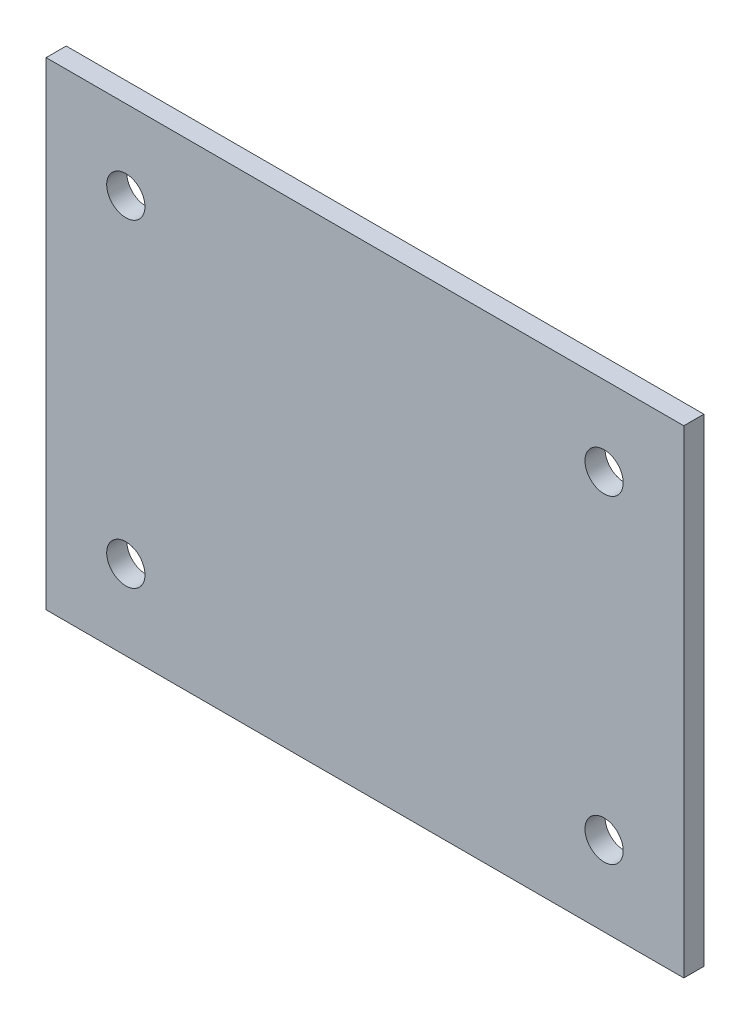
ISO-10303-21;
HEADER;
FILE_DESCRIPTION(('STEP AP214'),'2;1');
FILE_NAME('part.step','',(''),(''),'','','');
FILE_SCHEMA(('AUTOMOTIVE_DESIGN { 1 0 10303 214 1 1 1 1 }'));
ENDSEC;
DATA;
#1=APPLICATION_CONTEXT('core data for automotive mechanical design processes');
#2=APPLICATION_PROTOCOL_DEFINITION('international standard','automotive_design',2000,#1);
#3=PRODUCT_CONTEXT('',#1,'mechanical');
#4=PRODUCT('Part','Part','',(#3));
#5=PRODUCT_RELATED_PRODUCT_CATEGORY('part','',(#4));
#6=PRODUCT_DEFINITION_FORMATION('','',#4);
#7=PRODUCT_DEFINITION_CONTEXT('part definition',#1,'design');
#8=PRODUCT_DEFINITION('design','',#6,#7);
#9=PRODUCT_DEFINITION_SHAPE('','',#8);
#10=(LENGTH_UNIT() NAMED_UNIT(*) SI_UNIT(.MILLI.,.METRE.));
#11=(NAMED_UNIT(*) PLANE_ANGLE_UNIT() SI_UNIT($,.RADIAN.));
#12=(NAMED_UNIT(*) SI_UNIT($,.STERADIAN.) SOLID_ANGLE_UNIT());
#13=UNCERTAINTY_MEASURE_WITH_UNIT(LENGTH_MEASURE(1.E-05),#10,'distance_accuracy_value','');
#14=(GEOMETRIC_REPRESENTATION_CONTEXT(3) GLOBAL_UNCERTAINTY_ASSIGNED_CONTEXT((#13)) GLOBAL_UNIT_ASSIGNED_CONTEXT((#10,
#11,#12)) REPRESENTATION_CONTEXT('',''));
#15=CARTESIAN_POINT('',(0.,0.,0.));
#16=DIRECTION('',(0.,0.,1.));
#17=DIRECTION('',(1.,0.,0.));
#18=AXIS2_PLACEMENT_3D('',#15,#16,#17);
#19=CARTESIAN_POINT('',(0.,0.,1.6002));
#20=DIRECTION('',(1.,0.,0.));
#21=DIRECTION('',(0.,1.,0.));
#22=AXIS2_PLACEMENT_3D('',#19,#20,#21);
#23=PLANE('',#22);
#24=DIRECTION('',(0.,-1.,0.));
#25=VECTOR('',#24,1.);
#26=CARTESIAN_POINT('',(0.,0.,0.));
#27=LINE('',#26,#25);
#28=CARTESIAN_POINT('',(0.,0.,0.));
#29=VERTEX_POINT('',#28);
#30=CARTESIAN_POINT('',(0.,-38.1,0.));
#31=VERTEX_POINT('',#30);
#32=EDGE_CURVE('E74',#29,#31,#27,.T.);
#33=ORIENTED_EDGE('',*,*,#32,.T.);
#34=DIRECTION('',(0.,0.,-1.));
#35=VECTOR('',#34,1.);
#36=CARTESIAN_POINT('',(0.,-38.1,1.6002));
#37=LINE('',#36,#35);
#38=CARTESIAN_POINT('',(0.,-38.1,1.6002));
#39=VERTEX_POINT('',#38);
#40=EDGE_CURVE('E81',#39,#31,#37,.T.);
#41=ORIENTED_EDGE('',*,*,#40,.F.);
#42=DIRECTION('',(0.,-1.,0.));
#43=VECTOR('',#42,1.);
#44=CARTESIAN_POINT('',(0.,0.,1.6002));
#45=LINE('',#44,#43);
#46=CARTESIAN_POINT('',(0.,0.,1.6002));
#47=VERTEX_POINT('',#46);
#48=EDGE_CURVE('E101',#47,#39,#45,.T.);
#49=ORIENTED_EDGE('',*,*,#48,.F.);
#50=DIRECTION('',(0.,0.,-1.));
#51=VECTOR('',#50,1.);
#52=CARTESIAN_POINT('',(0.,0.,1.6002));
#53=LINE('',#52,#51);
#54=EDGE_CURVE('E90',#47,#29,#53,.T.);
#55=ORIENTED_EDGE('',*,*,#54,.T.);
#56=EDGE_LOOP('',(#33,#41,#49,#55));
#57=FACE_BOUND('',#56,.T.);
#58=ADVANCED_FACE('F27',(#57),#23,.F.);
#59=CARTESIAN_POINT('',(0.,-38.1,1.6002));
#60=DIRECTION('',(0.,1.,0.));
#61=DIRECTION('',(0.,0.,1.));
#62=AXIS2_PLACEMENT_3D('',#59,#60,#61);
#63=PLANE('',#62);
#64=DIRECTION('',(1.,0.,0.));
#65=VECTOR('',#64,1.);
#66=CARTESIAN_POINT('',(0.,-38.1,0.));
#67=LINE('',#66,#65);
#68=CARTESIAN_POINT('',(50.8,-38.1,0.));
#69=VERTEX_POINT('',#68);
#70=EDGE_CURVE('E68',#31,#69,#67,.T.);
#71=ORIENTED_EDGE('',*,*,#70,.T.);
#72=DIRECTION('',(0.,0.,-1.));
#73=VECTOR('',#72,1.);
#74=CARTESIAN_POINT('',(50.8,-38.1,1.6002));
#75=LINE('',#74,#73);
#76=CARTESIAN_POINT('',(50.8,-38.1,1.6002));
#77=VERTEX_POINT('',#76);
#78=EDGE_CURVE('E87',#77,#69,#75,.T.);
#79=ORIENTED_EDGE('',*,*,#78,.F.);
#80=DIRECTION('',(1.,0.,0.));
#81=VECTOR('',#80,1.);
#82=CARTESIAN_POINT('',(0.,-38.1,1.6002));
#83=LINE('',#82,#81);
#84=EDGE_CURVE('E83',#39,#77,#83,.T.);
#85=ORIENTED_EDGE('',*,*,#84,.F.);
#86=ORIENTED_EDGE('',*,*,#40,.T.);
#87=EDGE_LOOP('',(#71,#79,#85,#86));
#88=FACE_BOUND('',#87,.T.);
#89=ADVANCED_FACE('F82',(#88),#63,.F.);
#90=CARTESIAN_POINT('',(50.8,0.,1.6002));
#91=DIRECTION('',(-1.,0.,0.));
#92=DIRECTION('',(0.,-1.,0.));
#93=AXIS2_PLACEMENT_3D('',#90,#91,#92);
#94=PLANE('',#93);
#95=DIRECTION('',(0.,1.,0.));
#96=VECTOR('',#95,1.);
#97=CARTESIAN_POINT('',(50.8,0.,0.));
#98=LINE('',#97,#96);
#99=CARTESIAN_POINT('',(50.8,0.,0.));
#100=VERTEX_POINT('',#99);
#101=EDGE_CURVE('E75',#69,#100,#98,.T.);
#102=ORIENTED_EDGE('',*,*,#101,.T.);
#103=DIRECTION('',(0.,0.,-1.));
#104=VECTOR('',#103,1.);
#105=CARTESIAN_POINT('',(50.8,0.,1.6002));
#106=LINE('',#105,#104);
#107=CARTESIAN_POINT('',(50.8,0.,1.6002));
#108=VERTEX_POINT('',#107);
#109=EDGE_CURVE('E107',#108,#100,#106,.T.);
#110=ORIENTED_EDGE('',*,*,#109,.F.);
#111=DIRECTION('',(0.,1.,0.));
#112=VECTOR('',#111,1.);
#113=CARTESIAN_POINT('',(50.8,0.,1.6002));
#114=LINE('',#113,#112);
#115=EDGE_CURVE('E47',#77,#108,#114,.T.);
#116=ORIENTED_EDGE('',*,*,#115,.F.);
#117=ORIENTED_EDGE('',*,*,#78,.T.);
#118=EDGE_LOOP('',(#102,#110,#116,#117));
#119=FACE_BOUND('',#118,.T.);
#120=ADVANCED_FACE('F137',(#119),#94,.F.);
#121=CARTESIAN_POINT('',(0.,0.,1.6002));
#122=DIRECTION('',(0.,-1.,0.));
#123=DIRECTION('',(1.,0.,0.));
#124=AXIS2_PLACEMENT_3D('',#121,#122,#123);
#125=PLANE('',#124);
#126=DIRECTION('',(-1.,0.,0.));
#127=VECTOR('',#126,1.);
#128=CARTESIAN_POINT('',(0.,0.,0.));
#129=LINE('',#128,#127);
#130=EDGE_CURVE('E99',#100,#29,#129,.T.);
#131=ORIENTED_EDGE('',*,*,#130,.T.);
#132=ORIENTED_EDGE('',*,*,#54,.F.);
#133=DIRECTION('',(-1.,0.,0.));
#134=VECTOR('',#133,1.);
#135=CARTESIAN_POINT('',(0.,0.,1.6002));
#136=LINE('',#135,#134);
#137=EDGE_CURVE('E42',#108,#47,#136,.T.);
#138=ORIENTED_EDGE('',*,*,#137,.F.);
#139=ORIENTED_EDGE('',*,*,#109,.T.);
#140=EDGE_LOOP('',(#131,#132,#138,#139));
#141=FACE_BOUND('',#140,.T.);
#142=ADVANCED_FACE('F126',(#141),#125,.F.);
#143=CARTESIAN_POINT('',(0.,-38.1,1.6002));
#144=DIRECTION('',(0.,0.,1.));
#145=DIRECTION('',(1.,0.,0.));
#146=AXIS2_PLACEMENT_3D('',#143,#144,#145);
#147=PLANE('',#146);
#148=CARTESIAN_POINT('',(44.45,-6.35,1.6002));
#149=DIRECTION('',(0.,0.,1.));
#150=DIRECTION('',(1.,0.,0.));
#151=AXIS2_PLACEMENT_3D('',#148,#149,#150);
#152=CIRCLE('',#151,1.524);
#153=CARTESIAN_POINT('',(45.974,-6.35,1.6002));
#154=VERTEX_POINT('',#153);
#155=EDGE_CURVE('E170',#154,#154,#152,.T.);
#156=ORIENTED_EDGE('',*,*,#155,.F.);
#157=EDGE_LOOP('',(#156));
#158=FACE_BOUND('',#157,.T.);
#159=CARTESIAN_POINT('',(6.35,-6.35,1.6002));
#160=DIRECTION('',(0.,0.,1.));
#161=DIRECTION('',(1.,0.,0.));
#162=AXIS2_PLACEMENT_3D('',#159,#160,#161);
#163=CIRCLE('',#162,1.524);
#164=CARTESIAN_POINT('',(7.874,-6.35,1.6002));
#165=VERTEX_POINT('',#164);
#166=EDGE_CURVE('E94',#165,#165,#163,.T.);
#167=ORIENTED_EDGE('',*,*,#166,.F.);
#168=EDGE_LOOP('',(#167));
#169=FACE_BOUND('',#168,.T.);
#170=ORIENTED_EDGE('',*,*,#48,.T.);
#171=ORIENTED_EDGE('',*,*,#84,.T.);
#172=ORIENTED_EDGE('',*,*,#115,.T.);
#173=ORIENTED_EDGE('',*,*,#137,.T.);
#174=EDGE_LOOP('',(#170,#171,#172,#173));
#175=FACE_BOUND('',#174,.T.);
#176=CARTESIAN_POINT('',(6.35,-31.75,1.6002));
#177=DIRECTION('',(0.,0.,1.));
#178=DIRECTION('',(1.,0.,0.));
#179=AXIS2_PLACEMENT_3D('',#176,#177,#178);
#180=CIRCLE('',#179,1.524);
#181=CARTESIAN_POINT('',(7.874,-31.75,1.6002));
#182=VERTEX_POINT('',#181);
#183=EDGE_CURVE('E113',#182,#182,#180,.T.);
#184=ORIENTED_EDGE('',*,*,#183,.F.);
#185=EDGE_LOOP('',(#184));
#186=FACE_BOUND('',#185,.T.);
#187=CARTESIAN_POINT('',(44.45,-31.75,1.6002));
#188=DIRECTION('',(0.,0.,1.));
#189=DIRECTION('',(1.,0.,0.));
#190=AXIS2_PLACEMENT_3D('',#187,#188,#189);
#191=CIRCLE('',#190,1.524);
#192=CARTESIAN_POINT('',(45.974,-31.75,1.6002));
#193=VERTEX_POINT('',#192);
#194=EDGE_CURVE('E11',#193,#193,#191,.T.);
#195=ORIENTED_EDGE('',*,*,#194,.F.);
#196=EDGE_LOOP('',(#195));
#197=FACE_BOUND('',#196,.T.);
#198=ADVANCED_FACE('F124',(#158,#169,#175,#186,#197),#147,.T.);
#199=CARTESIAN_POINT('',(0.,-38.1,0.));
#200=DIRECTION('',(0.,0.,1.));
#201=DIRECTION('',(1.,0.,0.));
#202=AXIS2_PLACEMENT_3D('',#199,#200,#201);
#203=PLANE('',#202);
#204=CARTESIAN_POINT('',(44.45,-6.35,0.));
#205=DIRECTION('',(0.,0.,1.));
#206=DIRECTION('',(1.,0.,0.));
#207=AXIS2_PLACEMENT_3D('',#204,#205,#206);
#208=CIRCLE('',#207,1.524);
#209=CARTESIAN_POINT('',(45.974,-6.35,0.));
#210=VERTEX_POINT('',#209);
#211=EDGE_CURVE('E168',#210,#210,#208,.T.);
#212=ORIENTED_EDGE('',*,*,#211,.T.);
#213=EDGE_LOOP('',(#212));
#214=FACE_BOUND('',#213,.T.);
#215=CARTESIAN_POINT('',(6.35,-6.35,0.));
#216=DIRECTION('',(0.,0.,1.));
#217=DIRECTION('',(1.,0.,0.));
#218=AXIS2_PLACEMENT_3D('',#215,#216,#217);
#219=CIRCLE('',#218,1.524);
#220=CARTESIAN_POINT('',(7.874,-6.35,0.));
#221=VERTEX_POINT('',#220);
#222=EDGE_CURVE('E91',#221,#221,#219,.T.);
#223=ORIENTED_EDGE('',*,*,#222,.T.);
#224=EDGE_LOOP('',(#223));
#225=FACE_BOUND('',#224,.T.);
#226=ORIENTED_EDGE('',*,*,#32,.F.);
#227=ORIENTED_EDGE('',*,*,#130,.F.);
#228=ORIENTED_EDGE('',*,*,#101,.F.);
#229=ORIENTED_EDGE('',*,*,#70,.F.);
#230=EDGE_LOOP('',(#226,#227,#228,#229));
#231=FACE_BOUND('',#230,.T.);
#232=CARTESIAN_POINT('',(6.35,-31.75,0.));
#233=DIRECTION('',(0.,0.,1.));
#234=DIRECTION('',(1.,0.,0.));
#235=AXIS2_PLACEMENT_3D('',#232,#233,#234);
#236=CIRCLE('',#235,1.524);
#237=CARTESIAN_POINT('',(7.874,-31.75,0.));
#238=VERTEX_POINT('',#237);
#239=EDGE_CURVE('E86',#238,#238,#236,.T.);
#240=ORIENTED_EDGE('',*,*,#239,.T.);
#241=EDGE_LOOP('',(#240));
#242=FACE_BOUND('',#241,.T.);
#243=CARTESIAN_POINT('',(44.45,-31.75,0.));
#244=DIRECTION('',(0.,0.,1.));
#245=DIRECTION('',(1.,0.,0.));
#246=AXIS2_PLACEMENT_3D('',#243,#244,#245);
#247=CIRCLE('',#246,1.524);
#248=CARTESIAN_POINT('',(45.974,-31.75,0.));
#249=VERTEX_POINT('',#248);
#250=EDGE_CURVE('E35',#249,#249,#247,.T.);
#251=ORIENTED_EDGE('',*,*,#250,.T.);
#252=EDGE_LOOP('',(#251));
#253=FACE_BOUND('',#252,.T.);
#254=ADVANCED_FACE('F70',(#214,#225,#231,#242,#253),#203,.F.);
#255=CARTESIAN_POINT('',(6.35,-6.35,0.));
#256=DIRECTION('',(0.,0.,1.));
#257=DIRECTION('',(1.,0.,0.));
#258=AXIS2_PLACEMENT_3D('',#255,#256,#257);
#259=CYLINDRICAL_SURFACE('',#258,1.524);
#260=ORIENTED_EDGE('',*,*,#222,.F.);
#261=EDGE_LOOP('',(#260));
#262=FACE_BOUND('',#261,.T.);
#263=ORIENTED_EDGE('',*,*,#166,.T.);
#264=EDGE_LOOP('',(#263));
#265=FACE_BOUND('',#264,.T.);
#266=ADVANCED_FACE('F133',(#262,#265),#259,.F.);
#267=CARTESIAN_POINT('',(44.45,-6.35,0.));
#268=DIRECTION('',(0.,0.,1.));
#269=DIRECTION('',(1.,0.,0.));
#270=AXIS2_PLACEMENT_3D('',#267,#268,#269);
#271=CYLINDRICAL_SURFACE('',#270,1.524);
#272=ORIENTED_EDGE('',*,*,#211,.F.);
#273=EDGE_LOOP('',(#272));
#274=FACE_BOUND('',#273,.T.);
#275=ORIENTED_EDGE('',*,*,#155,.T.);
#276=EDGE_LOOP('',(#275));
#277=FACE_BOUND('',#276,.T.);
#278=ADVANCED_FACE('F150',(#274,#277),#271,.F.);
#279=CARTESIAN_POINT('',(6.35,-31.75,0.));
#280=DIRECTION('',(0.,0.,1.));
#281=DIRECTION('',(1.,0.,0.));
#282=AXIS2_PLACEMENT_3D('',#279,#280,#281);
#283=CYLINDRICAL_SURFACE('',#282,1.524);
#284=ORIENTED_EDGE('',*,*,#239,.F.);
#285=EDGE_LOOP('',(#284));
#286=FACE_BOUND('',#285,.T.);
#287=ORIENTED_EDGE('',*,*,#183,.T.);
#288=EDGE_LOOP('',(#287));
#289=FACE_BOUND('',#288,.T.);
#290=ADVANCED_FACE('F121',(#286,#289),#283,.F.);
#291=CARTESIAN_POINT('',(44.45,-31.75,0.));
#292=DIRECTION('',(0.,0.,1.));
#293=DIRECTION('',(1.,0.,0.));
#294=AXIS2_PLACEMENT_3D('',#291,#292,#293);
#295=CYLINDRICAL_SURFACE('',#294,1.524);
#296=ORIENTED_EDGE('',*,*,#250,.F.);
#297=EDGE_LOOP('',(#296));
#298=FACE_BOUND('',#297,.T.);
#299=ORIENTED_EDGE('',*,*,#194,.T.);
#300=EDGE_LOOP('',(#299));
#301=FACE_BOUND('',#300,.T.);
#302=ADVANCED_FACE('F29',(#298,#301),#295,.F.);
#303=CLOSED_SHELL('',(#58,#89,#120,#142,#198,#254,#266,#278,#290,#302));
#304=MANIFOLD_SOLID_BREP('B2',#303);
#305=ADVANCED_BREP_SHAPE_REPRESENTATION('',(#18,#304),#14);
#306=SHAPE_DEFINITION_REPRESENTATION(#9,#305);
ENDSEC;
END-ISO-10303-21;
